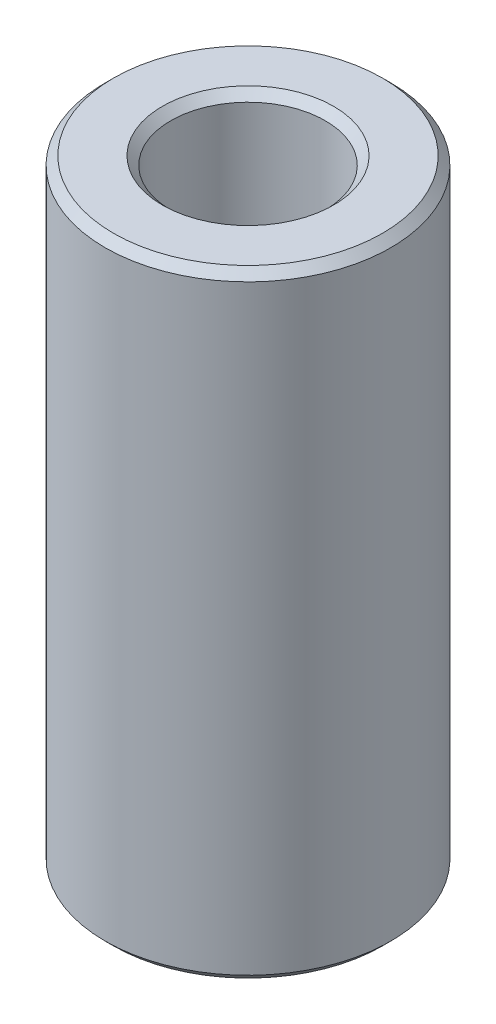
ISO-10303-21;
HEADER;
FILE_DESCRIPTION(('STEP AP214'),'2;1');
FILE_NAME('part.step','',(''),(''),'','','');
FILE_SCHEMA(('AUTOMOTIVE_DESIGN { 1 0 10303 214 1 1 1 1 }'));
ENDSEC;
DATA;
#1=APPLICATION_CONTEXT('core data for automotive mechanical design processes');
#2=APPLICATION_PROTOCOL_DEFINITION('international standard','automotive_design',2000,#1);
#3=PRODUCT_CONTEXT('',#1,'mechanical');
#4=PRODUCT('Part','Part','',(#3));
#5=PRODUCT_RELATED_PRODUCT_CATEGORY('part','',(#4));
#6=PRODUCT_DEFINITION_FORMATION('','',#4);
#7=PRODUCT_DEFINITION_CONTEXT('part definition',#1,'design');
#8=PRODUCT_DEFINITION('design','',#6,#7);
#9=PRODUCT_DEFINITION_SHAPE('','',#8);
#10=(LENGTH_UNIT() NAMED_UNIT(*) SI_UNIT(.MILLI.,.METRE.));
#11=(NAMED_UNIT(*) PLANE_ANGLE_UNIT() SI_UNIT($,.RADIAN.));
#12=(NAMED_UNIT(*) SI_UNIT($,.STERADIAN.) SOLID_ANGLE_UNIT());
#13=UNCERTAINTY_MEASURE_WITH_UNIT(LENGTH_MEASURE(1.E-05),#10,'distance_accuracy_value','');
#14=(GEOMETRIC_REPRESENTATION_CONTEXT(3) GLOBAL_UNCERTAINTY_ASSIGNED_CONTEXT((#13)) GLOBAL_UNIT_ASSIGNED_CONTEXT((#10,
#11,#12)) REPRESENTATION_CONTEXT('',''));
#15=CARTESIAN_POINT('',(0.,0.,0.));
#16=DIRECTION('',(0.,0.,1.));
#17=DIRECTION('',(1.,0.,0.));
#18=AXIS2_PLACEMENT_3D('',#15,#16,#17);
#19=CARTESIAN_POINT('',(0.,108.041205704441,0.));
#20=DIRECTION('',(0.,-1.,0.));
#21=DIRECTION('',(0.,0.,-1.));
#22=AXIS2_PLACEMENT_3D('',#19,#20,#21);
#23=CYLINDRICAL_SURFACE('',#22,25.);
#24=CARTESIAN_POINT('',(0.,1.45651261055481,0.));
#25=DIRECTION('',(0.,1.,0.));
#26=DIRECTION('',(0.,0.,1.));
#27=AXIS2_PLACEMENT_3D('',#24,#25,#26);
#28=CIRCLE('',#27,25.);
#29=CARTESIAN_POINT('',(0.,1.45651261055481,25.));
#30=VERTEX_POINT('',#29);
#31=EDGE_CURVE('E10',#30,#30,#28,.T.);
#32=ORIENTED_EDGE('',*,*,#31,.T.);
#33=EDGE_LOOP('',(#32));
#34=FACE_BOUND('',#33,.T.);
#35=CARTESIAN_POINT('',(0.,106.584693093886,0.));
#36=DIRECTION('',(0.,1.,0.));
#37=DIRECTION('',(0.,0.,1.));
#38=AXIS2_PLACEMENT_3D('',#35,#36,#37);
#39=CIRCLE('',#38,25.);
#40=CARTESIAN_POINT('',(0.,106.584693093886,25.));
#41=VERTEX_POINT('',#40);
#42=EDGE_CURVE('E50',#41,#41,#39,.F.);
#43=ORIENTED_EDGE('',*,*,#42,.T.);
#44=EDGE_LOOP('',(#43));
#45=FACE_BOUND('',#44,.T.);
#46=ADVANCED_FACE('F39',(#34,#45),#23,.T.);
#47=CARTESIAN_POINT('',(0.,108.041205704441,0.));
#48=DIRECTION('',(0.,1.,0.));
#49=DIRECTION('',(0.,0.,1.));
#50=AXIS2_PLACEMENT_3D('',#47,#48,#49);
#51=PLANE('',#50);
#52=CARTESIAN_POINT('',(0.,108.041205704441,0.));
#53=DIRECTION('',(0.,1.,0.));
#54=DIRECTION('',(0.,0.,1.));
#55=AXIS2_PLACEMENT_3D('',#52,#53,#54);
#56=CIRCLE('',#55,14.9884153226574);
#57=CARTESIAN_POINT('',(0.,108.041205704441,14.9884153226574));
#58=VERTEX_POINT('',#57);
#59=EDGE_CURVE('E58',#58,#58,#56,.F.);
#60=ORIENTED_EDGE('',*,*,#59,.T.);
#61=EDGE_LOOP('',(#60));
#62=FACE_BOUND('',#61,.T.);
#63=CARTESIAN_POINT('',(0.,108.041205704441,0.));
#64=DIRECTION('',(0.,1.,0.));
#65=DIRECTION('',(0.,0.,1.));
#66=AXIS2_PLACEMENT_3D('',#63,#64,#65);
#67=CIRCLE('',#66,23.5434873894451);
#68=CARTESIAN_POINT('',(0.,108.041205704441,23.5434873894451));
#69=VERTEX_POINT('',#68);
#70=EDGE_CURVE('E61',#69,#69,#67,.T.);
#71=ORIENTED_EDGE('',*,*,#70,.T.);
#72=EDGE_LOOP('',(#71));
#73=FACE_BOUND('',#72,.T.);
#74=ADVANCED_FACE('F88',(#62,#73),#51,.T.);
#75=CARTESIAN_POINT('',(0.,0.,0.));
#76=DIRECTION('',(0.,1.,0.));
#77=DIRECTION('',(0.,0.,1.));
#78=AXIS2_PLACEMENT_3D('',#75,#76,#77);
#79=PLANE('',#78);
#80=CARTESIAN_POINT('',(0.,0.,0.));
#81=DIRECTION('',(0.,1.,0.));
#82=DIRECTION('',(0.,0.,1.));
#83=AXIS2_PLACEMENT_3D('',#80,#81,#82);
#84=CIRCLE('',#83,14.9884153226574);
#85=CARTESIAN_POINT('',(0.,0.,14.9884153226574));
#86=VERTEX_POINT('',#85);
#87=EDGE_CURVE('E51',#86,#86,#84,.T.);
#88=ORIENTED_EDGE('',*,*,#87,.T.);
#89=EDGE_LOOP('',(#88));
#90=FACE_BOUND('',#89,.T.);
#91=CARTESIAN_POINT('',(0.,0.,0.));
#92=DIRECTION('',(0.,1.,0.));
#93=DIRECTION('',(0.,0.,1.));
#94=AXIS2_PLACEMENT_3D('',#91,#92,#93);
#95=CIRCLE('',#94,23.5434873894452);
#96=CARTESIAN_POINT('',(0.,0.,23.5434873894452));
#97=VERTEX_POINT('',#96);
#98=EDGE_CURVE('E54',#97,#97,#95,.F.);
#99=ORIENTED_EDGE('',*,*,#98,.T.);
#100=EDGE_LOOP('',(#99));
#101=FACE_BOUND('',#100,.T.);
#102=ADVANCED_FACE('F83',(#90,#101),#79,.F.);
#103=CARTESIAN_POINT('',(0.,108.041205704441,0.));
#104=DIRECTION('',(0.,-1.,0.));
#105=DIRECTION('',(0.,0.,-1.));
#106=AXIS2_PLACEMENT_3D('',#103,#104,#105);
#107=CYLINDRICAL_SURFACE('',#106,13.5319027121026);
#108=CARTESIAN_POINT('',(0.,106.584693093886,0.));
#109=DIRECTION('',(0.,1.,0.));
#110=DIRECTION('',(0.,0.,1.));
#111=AXIS2_PLACEMENT_3D('',#108,#109,#110);
#112=CIRCLE('',#111,13.5319027121026);
#113=CARTESIAN_POINT('',(0.,106.584693093886,13.5319027121026));
#114=VERTEX_POINT('',#113);
#115=EDGE_CURVE('E67',#114,#114,#112,.T.);
#116=ORIENTED_EDGE('',*,*,#115,.T.);
#117=EDGE_LOOP('',(#116));
#118=FACE_BOUND('',#117,.T.);
#119=CARTESIAN_POINT('',(0.,1.45651261055486,0.));
#120=DIRECTION('',(0.,1.,0.));
#121=DIRECTION('',(0.,0.,1.));
#122=AXIS2_PLACEMENT_3D('',#119,#120,#121);
#123=CIRCLE('',#122,13.5319027121026);
#124=CARTESIAN_POINT('',(0.,1.45651261055486,13.5319027121026));
#125=VERTEX_POINT('',#124);
#126=EDGE_CURVE('E69',#125,#125,#123,.F.);
#127=ORIENTED_EDGE('',*,*,#126,.T.);
#128=EDGE_LOOP('',(#127));
#129=FACE_BOUND('',#128,.T.);
#130=ADVANCED_FACE('F71',(#118,#129),#107,.F.);
#131=CARTESIAN_POINT('',(0.,106.584693093886,0.));
#132=DIRECTION('',(0.,1.,0.));
#133=DIRECTION('',(0.,0.,1.));
#134=AXIS2_PLACEMENT_3D('',#131,#132,#133);
#135=CONICAL_SURFACE('',#134,13.5319027121026,0.785398163397448);
#136=ORIENTED_EDGE('',*,*,#59,.F.);
#137=EDGE_LOOP('',(#136));
#138=FACE_BOUND('',#137,.T.);
#139=ORIENTED_EDGE('',*,*,#115,.F.);
#140=EDGE_LOOP('',(#139));
#141=FACE_BOUND('',#140,.T.);
#142=ADVANCED_FACE('F77',(#138,#141),#135,.F.);
#143=CARTESIAN_POINT('',(0.,0.,0.));
#144=DIRECTION('',(0.,-1.,0.));
#145=DIRECTION('',(0.,0.,-1.));
#146=AXIS2_PLACEMENT_3D('',#143,#144,#145);
#147=CONICAL_SURFACE('',#146,14.9884153226574,0.785398163397439);
#148=ORIENTED_EDGE('',*,*,#126,.F.);
#149=EDGE_LOOP('',(#148));
#150=FACE_BOUND('',#149,.T.);
#151=ORIENTED_EDGE('',*,*,#87,.F.);
#152=EDGE_LOOP('',(#151));
#153=FACE_BOUND('',#152,.T.);
#154=ADVANCED_FACE('F73',(#150,#153),#147,.F.);
#155=CARTESIAN_POINT('',(0.,1.45651261055481,0.));
#156=DIRECTION('',(0.,1.,0.));
#157=DIRECTION('',(0.,0.,1.));
#158=AXIS2_PLACEMENT_3D('',#155,#156,#157);
#159=CONICAL_SURFACE('',#158,25.,0.785398163397454);
#160=ORIENTED_EDGE('',*,*,#98,.F.);
#161=EDGE_LOOP('',(#160));
#162=FACE_BOUND('',#161,.T.);
#163=ORIENTED_EDGE('',*,*,#31,.F.);
#164=EDGE_LOOP('',(#163));
#165=FACE_BOUND('',#164,.T.);
#166=ADVANCED_FACE('F76',(#162,#165),#159,.T.);
#167=CARTESIAN_POINT('',(0.,108.041205704441,0.));
#168=DIRECTION('',(0.,-1.,0.));
#169=DIRECTION('',(0.,0.,-1.));
#170=AXIS2_PLACEMENT_3D('',#167,#168,#169);
#171=CONICAL_SURFACE('',#170,23.5434873894451,0.785398163397446);
#172=ORIENTED_EDGE('',*,*,#42,.F.);
#173=EDGE_LOOP('',(#172));
#174=FACE_BOUND('',#173,.T.);
#175=ORIENTED_EDGE('',*,*,#70,.F.);
#176=EDGE_LOOP('',(#175));
#177=FACE_BOUND('',#176,.T.);
#178=ADVANCED_FACE('F45',(#174,#177),#171,.T.);
#179=CLOSED_SHELL('',(#46,#74,#102,#130,#142,#154,#166,#178));
#180=MANIFOLD_SOLID_BREP('B2',#179);
#181=ADVANCED_BREP_SHAPE_REPRESENTATION('',(#18,#180),#14);
#182=SHAPE_DEFINITION_REPRESENTATION(#9,#181);
ENDSEC;
END-ISO-10303-21;
